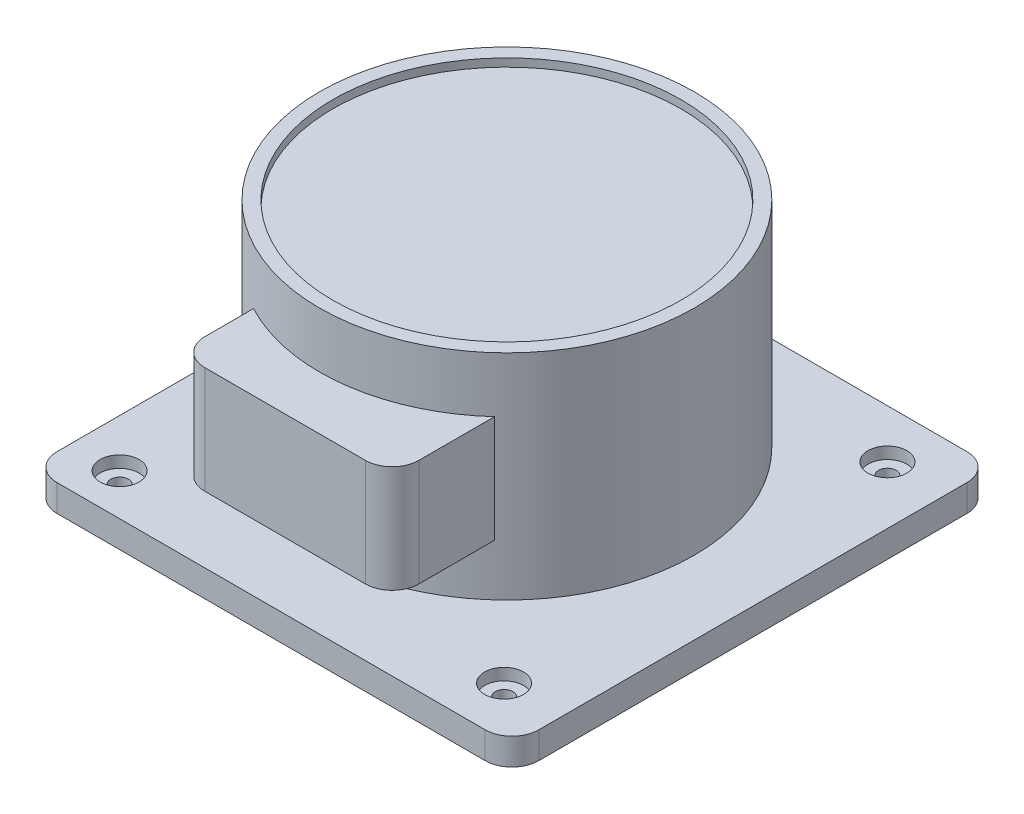
ISO-10303-21;
HEADER;
FILE_DESCRIPTION(('STEP AP214'),'2;1');
FILE_NAME('part.step','',(''),(''),'','','');
FILE_SCHEMA(('AUTOMOTIVE_DESIGN { 1 0 10303 214 1 1 1 1 }'));
ENDSEC;
DATA;
#1=APPLICATION_CONTEXT('core data for automotive mechanical design processes');
#2=APPLICATION_PROTOCOL_DEFINITION('international standard','automotive_design',2000,#1);
#3=PRODUCT_CONTEXT('',#1,'mechanical');
#4=PRODUCT('Part','Part','',(#3));
#5=PRODUCT_RELATED_PRODUCT_CATEGORY('part','',(#4));
#6=PRODUCT_DEFINITION_FORMATION('','',#4);
#7=PRODUCT_DEFINITION_CONTEXT('part definition',#1,'design');
#8=PRODUCT_DEFINITION('design','',#6,#7);
#9=PRODUCT_DEFINITION_SHAPE('','',#8);
#10=(LENGTH_UNIT() NAMED_UNIT(*) SI_UNIT(.MILLI.,.METRE.));
#11=(NAMED_UNIT(*) PLANE_ANGLE_UNIT() SI_UNIT($,.RADIAN.));
#12=(NAMED_UNIT(*) SI_UNIT($,.STERADIAN.) SOLID_ANGLE_UNIT());
#13=UNCERTAINTY_MEASURE_WITH_UNIT(LENGTH_MEASURE(1.E-05),#10,'distance_accuracy_value','');
#14=(GEOMETRIC_REPRESENTATION_CONTEXT(3) GLOBAL_UNCERTAINTY_ASSIGNED_CONTEXT((#13)) GLOBAL_UNIT_ASSIGNED_CONTEXT((#10,
#11,#12)) REPRESENTATION_CONTEXT('',''));
#15=CARTESIAN_POINT('',(0.,0.,0.));
#16=DIRECTION('',(0.,0.,1.));
#17=DIRECTION('',(1.,0.,0.));
#18=AXIS2_PLACEMENT_3D('',#15,#16,#17);
#19=CARTESIAN_POINT('',(-57.0066668541926,90.,0.));
#20=DIRECTION('',(0.,-1.,0.));
#21=DIRECTION('',(0.,0.,-1.));
#22=AXIS2_PLACEMENT_3D('',#19,#20,#21);
#23=CYLINDRICAL_SURFACE('',#22,70.);
#24=CARTESIAN_POINT('',(-57.0066668541926,10.,0.));
#25=DIRECTION('',(0.,1.,0.));
#26=DIRECTION('',(0.,0.,1.));
#27=AXIS2_PLACEMENT_3D('',#24,#25,#26);
#28=CIRCLE('',#27,70.);
#29=CARTESIAN_POINT('',(-57.0066668541926,10.,70.));
#30=VERTEX_POINT('',#29);
#31=EDGE_CURVE('E161',#30,#30,#28,.T.);
#32=ORIENTED_EDGE('',*,*,#31,.T.);
#33=EDGE_LOOP('',(#32));
#34=FACE_BOUND('',#33,.T.);
#35=CARTESIAN_POINT('',(-57.0066668541926,90.,0.));
#36=DIRECTION('',(0.,1.,0.));
#37=DIRECTION('',(0.,0.,1.));
#38=AXIS2_PLACEMENT_3D('',#35,#36,#37);
#39=CIRCLE('',#38,70.);
#40=CARTESIAN_POINT('',(-57.0066668541926,90.,70.));
#41=VERTEX_POINT('',#40);
#42=EDGE_CURVE('E236',#41,#41,#39,.T.);
#43=ORIENTED_EDGE('',*,*,#42,.F.);
#44=EDGE_LOOP('',(#43));
#45=FACE_BOUND('',#44,.T.);
#46=DIRECTION('',(0.,-1.,0.));
#47=VECTOR('',#46,1.);
#48=CARTESIAN_POINT('',(-89.8939404265472,90.,61.793423897508));
#49=LINE('',#48,#47);
#50=CARTESIAN_POINT('',(-89.8939404265472,69.2885310548801,61.793423897508));
#51=VERTEX_POINT('',#50);
#52=CARTESIAN_POINT('',(-89.8939404265472,29.2885310548801,61.793423897508));
#53=VERTEX_POINT('',#52);
#54=EDGE_CURVE('E138',#51,#53,#49,.T.);
#55=ORIENTED_EDGE('',*,*,#54,.F.);
#56=CARTESIAN_POINT('',(-57.0066668541926,69.2885310548801,0.));
#57=DIRECTION('',(0.,-1.,0.));
#58=DIRECTION('',(0.,0.,-1.));
#59=AXIS2_PLACEMENT_3D('',#56,#57,#58);
#60=CIRCLE('',#59,70.);
#61=CARTESIAN_POINT('',(-9.89394042654722,69.2885310548801,51.7724927790216));
#62=VERTEX_POINT('',#61);
#63=EDGE_CURVE('E151',#62,#51,#60,.T.);
#64=ORIENTED_EDGE('',*,*,#63,.F.);
#65=DIRECTION('',(0.,-1.,0.));
#66=VECTOR('',#65,1.);
#67=CARTESIAN_POINT('',(-9.8939404265472,90.,51.7724927790216));
#68=LINE('',#67,#66);
#69=CARTESIAN_POINT('',(-9.8939404265472,29.2885310548801,51.7724927790216));
#70=VERTEX_POINT('',#69);
#71=EDGE_CURVE('E160',#70,#62,#68,.F.);
#72=ORIENTED_EDGE('',*,*,#71,.F.);
#73=CARTESIAN_POINT('',(-57.0066668541926,29.2885310548801,0.));
#74=DIRECTION('',(0.,1.,0.));
#75=DIRECTION('',(-1.,0.,0.));
#76=AXIS2_PLACEMENT_3D('',#73,#74,#75);
#77=CIRCLE('',#76,70.);
#78=EDGE_CURVE('E154',#53,#70,#77,.T.);
#79=ORIENTED_EDGE('',*,*,#78,.F.);
#80=EDGE_LOOP('',(#55,#64,#72,#79));
#81=FACE_BOUND('',#80,.T.);
#82=ADVANCED_FACE('F32',(#34,#45,#81),#23,.T.);
#83=CARTESIAN_POINT('',(-139.591836734694,10.,-84.4897959183673));
#84=DIRECTION('',(1.,0.,0.));
#85=DIRECTION('',(0.,0.,-1.));
#86=AXIS2_PLACEMENT_3D('',#83,#84,#85);
#87=PLANE('',#86);
#88=DIRECTION('',(0.,0.,1.));
#89=VECTOR('',#88,1.);
#90=CARTESIAN_POINT('',(-139.591836734694,10.,-84.4897959183673));
#91=LINE('',#90,#89);
#92=CARTESIAN_POINT('',(-139.591836734694,10.,-74.4897959183673));
#93=VERTEX_POINT('',#92);
#94=CARTESIAN_POINT('',(-139.591836734694,10.,85.5102040816326));
#95=VERTEX_POINT('',#94);
#96=EDGE_CURVE('E244',#93,#95,#91,.T.);
#97=ORIENTED_EDGE('',*,*,#96,.F.);
#98=DIRECTION('',(0.,-1.,0.));
#99=VECTOR('',#98,1.);
#100=CARTESIAN_POINT('',(-139.591836734694,10.,-74.4897959183673));
#101=LINE('',#100,#99);
#102=CARTESIAN_POINT('',(-139.591836734694,0.,-74.4897959183673));
#103=VERTEX_POINT('',#102);
#104=EDGE_CURVE('E190',#93,#103,#101,.T.);
#105=ORIENTED_EDGE('',*,*,#104,.T.);
#106=DIRECTION('',(0.,0.,1.));
#107=VECTOR('',#106,1.);
#108=CARTESIAN_POINT('',(-139.591836734694,0.,-84.4897959183673));
#109=LINE('',#108,#107);
#110=CARTESIAN_POINT('',(-139.591836734694,0.,85.5102040816326));
#111=VERTEX_POINT('',#110);
#112=EDGE_CURVE('E234',#103,#111,#109,.T.);
#113=ORIENTED_EDGE('',*,*,#112,.T.);
#114=DIRECTION('',(0.,-1.,0.));
#115=VECTOR('',#114,1.);
#116=CARTESIAN_POINT('',(-139.591836734694,10.,85.5102040816327));
#117=LINE('',#116,#115);
#118=EDGE_CURVE('E188',#111,#95,#117,.F.);
#119=ORIENTED_EDGE('',*,*,#118,.T.);
#120=EDGE_LOOP('',(#97,#105,#113,#119));
#121=FACE_BOUND('',#120,.T.);
#122=ADVANCED_FACE('F339',(#121),#87,.F.);
#123=CARTESIAN_POINT('',(-139.591836734694,10.,95.5102040816327));
#124=DIRECTION('',(0.,0.,-1.));
#125=DIRECTION('',(-1.,0.,0.));
#126=AXIS2_PLACEMENT_3D('',#123,#124,#125);
#127=PLANE('',#126);
#128=DIRECTION('',(1.,0.,0.));
#129=VECTOR('',#128,1.);
#130=CARTESIAN_POINT('',(-139.591836734694,0.,95.5102040816327));
#131=LINE('',#130,#129);
#132=CARTESIAN_POINT('',(-129.591836734694,0.,95.5102040816327));
#133=VERTEX_POINT('',#132);
#134=CARTESIAN_POINT('',(30.4081632653062,0.,95.5102040816327));
#135=VERTEX_POINT('',#134);
#136=EDGE_CURVE('E223',#133,#135,#131,.T.);
#137=ORIENTED_EDGE('',*,*,#136,.T.);
#138=DIRECTION('',(0.,-1.,0.));
#139=VECTOR('',#138,1.);
#140=CARTESIAN_POINT('',(30.4081632653062,10.,95.5102040816327));
#141=LINE('',#140,#139);
#142=CARTESIAN_POINT('',(30.4081632653062,10.,95.5102040816327));
#143=VERTEX_POINT('',#142);
#144=EDGE_CURVE('E11',#135,#143,#141,.F.);
#145=ORIENTED_EDGE('',*,*,#144,.T.);
#146=DIRECTION('',(1.,0.,0.));
#147=VECTOR('',#146,1.);
#148=CARTESIAN_POINT('',(-139.591836734694,10.,95.5102040816327));
#149=LINE('',#148,#147);
#150=CARTESIAN_POINT('',(-129.591836734694,10.,95.5102040816327));
#151=VERTEX_POINT('',#150);
#152=EDGE_CURVE('E225',#151,#143,#149,.T.);
#153=ORIENTED_EDGE('',*,*,#152,.F.);
#154=DIRECTION('',(0.,-1.,0.));
#155=VECTOR('',#154,1.);
#156=CARTESIAN_POINT('',(-129.591836734694,10.,95.5102040816327));
#157=LINE('',#156,#155);
#158=EDGE_CURVE('E40',#151,#133,#157,.T.);
#159=ORIENTED_EDGE('',*,*,#158,.T.);
#160=EDGE_LOOP('',(#137,#145,#153,#159));
#161=FACE_BOUND('',#160,.T.);
#162=ADVANCED_FACE('F222',(#161),#127,.F.);
#163=CARTESIAN_POINT('',(40.4081632653061,10.,-84.4897959183674));
#164=DIRECTION('',(-1.,0.,0.));
#165=DIRECTION('',(0.,0.,1.));
#166=AXIS2_PLACEMENT_3D('',#163,#164,#165);
#167=PLANE('',#166);
#168=DIRECTION('',(0.,0.,-1.));
#169=VECTOR('',#168,1.);
#170=CARTESIAN_POINT('',(40.4081632653061,0.,-84.4897959183674));
#171=LINE('',#170,#169);
#172=CARTESIAN_POINT('',(40.4081632653062,0.,85.5102040816326));
#173=VERTEX_POINT('',#172);
#174=CARTESIAN_POINT('',(40.4081632653061,0.,-74.4897959183674));
#175=VERTEX_POINT('',#174);
#176=EDGE_CURVE('E233',#173,#175,#171,.T.);
#177=ORIENTED_EDGE('',*,*,#176,.T.);
#178=DIRECTION('',(0.,-1.,0.));
#179=VECTOR('',#178,1.);
#180=CARTESIAN_POINT('',(40.4081632653061,10.,-74.4897959183674));
#181=LINE('',#180,#179);
#182=CARTESIAN_POINT('',(40.4081632653061,10.,-74.4897959183674));
#183=VERTEX_POINT('',#182);
#184=EDGE_CURVE('E47',#175,#183,#181,.F.);
#185=ORIENTED_EDGE('',*,*,#184,.T.);
#186=DIRECTION('',(0.,0.,-1.));
#187=VECTOR('',#186,1.);
#188=CARTESIAN_POINT('',(40.4081632653061,10.,-84.4897959183674));
#189=LINE('',#188,#187);
#190=CARTESIAN_POINT('',(40.4081632653062,10.,85.5102040816326));
#191=VERTEX_POINT('',#190);
#192=EDGE_CURVE('E241',#191,#183,#189,.T.);
#193=ORIENTED_EDGE('',*,*,#192,.F.);
#194=DIRECTION('',(0.,-1.,0.));
#195=VECTOR('',#194,1.);
#196=CARTESIAN_POINT('',(40.4081632653062,10.,85.5102040816327));
#197=LINE('',#196,#195);
#198=EDGE_CURVE('E213',#191,#173,#197,.T.);
#199=ORIENTED_EDGE('',*,*,#198,.T.);
#200=EDGE_LOOP('',(#177,#185,#193,#199));
#201=FACE_BOUND('',#200,.T.);
#202=ADVANCED_FACE('F345',(#201),#167,.F.);
#203=CARTESIAN_POINT('',(-139.591836734694,10.,-84.4897959183673));
#204=DIRECTION('',(0.,0.,1.));
#205=DIRECTION('',(1.,0.,0.));
#206=AXIS2_PLACEMENT_3D('',#203,#204,#205);
#207=PLANE('',#206);
#208=DIRECTION('',(-1.,0.,0.));
#209=VECTOR('',#208,1.);
#210=CARTESIAN_POINT('',(-139.591836734694,0.,-84.4897959183673));
#211=LINE('',#210,#209);
#212=CARTESIAN_POINT('',(30.408163265306,0.,-84.4897959183674));
#213=VERTEX_POINT('',#212);
#214=CARTESIAN_POINT('',(-129.591836734694,0.,-84.4897959183673));
#215=VERTEX_POINT('',#214);
#216=EDGE_CURVE('E168',#213,#215,#211,.T.);
#217=ORIENTED_EDGE('',*,*,#216,.T.);
#218=DIRECTION('',(0.,-1.,0.));
#219=VECTOR('',#218,1.);
#220=CARTESIAN_POINT('',(-129.591836734694,10.,-84.4897959183673));
#221=LINE('',#220,#219);
#222=CARTESIAN_POINT('',(-129.591836734694,10.,-84.4897959183673));
#223=VERTEX_POINT('',#222);
#224=EDGE_CURVE('E204',#215,#223,#221,.F.);
#225=ORIENTED_EDGE('',*,*,#224,.T.);
#226=DIRECTION('',(-1.,0.,0.));
#227=VECTOR('',#226,1.);
#228=CARTESIAN_POINT('',(-139.591836734694,10.,-84.4897959183673));
#229=LINE('',#228,#227);
#230=CARTESIAN_POINT('',(30.408163265306,10.,-84.4897959183674));
#231=VERTEX_POINT('',#230);
#232=EDGE_CURVE('E165',#231,#223,#229,.T.);
#233=ORIENTED_EDGE('',*,*,#232,.F.);
#234=DIRECTION('',(0.,-1.,0.));
#235=VECTOR('',#234,1.);
#236=CARTESIAN_POINT('',(30.4081632653061,10.,-84.4897959183674));
#237=LINE('',#236,#235);
#238=EDGE_CURVE('E201',#231,#213,#237,.T.);
#239=ORIENTED_EDGE('',*,*,#238,.T.);
#240=EDGE_LOOP('',(#217,#225,#233,#239));
#241=FACE_BOUND('',#240,.T.);
#242=ADVANCED_FACE('F319',(#241),#207,.F.);
#243=CARTESIAN_POINT('',(0.,10.,0.));
#244=DIRECTION('',(0.,1.,0.));
#245=DIRECTION('',(0.,0.,1.));
#246=AXIS2_PLACEMENT_3D('',#243,#244,#245);
#247=PLANE('',#246);
#248=CARTESIAN_POINT('',(-121.727687167638,10.,-66.3147180673324));
#249=DIRECTION('',(0.,1.,0.));
#250=DIRECTION('',(0.,0.,1.));
#251=AXIS2_PLACEMENT_3D('',#248,#249,#250);
#252=CIRCLE('',#251,7.27499999999999);
#253=CARTESIAN_POINT('',(-121.727687167638,10.,-59.0397180673324));
#254=VERTEX_POINT('',#253);
#255=EDGE_CURVE('E310',#254,#254,#252,.T.);
#256=ORIENTED_EDGE('',*,*,#255,.F.);
#257=EDGE_LOOP('',(#256));
#258=FACE_BOUND('',#257,.T.);
#259=CARTESIAN_POINT('',(18.8544200343106,10.,-66.3147180673324));
#260=DIRECTION('',(0.,1.,0.));
#261=DIRECTION('',(0.,0.,1.));
#262=AXIS2_PLACEMENT_3D('',#259,#260,#261);
#263=CIRCLE('',#262,7.27499999999999);
#264=CARTESIAN_POINT('',(18.8544200343106,10.,-59.0397180673324));
#265=VERTEX_POINT('',#264);
#266=EDGE_CURVE('E298',#265,#265,#263,.T.);
#267=ORIENTED_EDGE('',*,*,#266,.F.);
#268=EDGE_LOOP('',(#267));
#269=FACE_BOUND('',#268,.T.);
#270=CARTESIAN_POINT('',(18.8544200343106,10.,76.9115666995437));
#271=DIRECTION('',(0.,1.,0.));
#272=DIRECTION('',(0.,0.,1.));
#273=AXIS2_PLACEMENT_3D('',#270,#271,#272);
#274=CIRCLE('',#273,7.27499999999999);
#275=CARTESIAN_POINT('',(18.8544200343106,10.,84.1865666995436));
#276=VERTEX_POINT('',#275);
#277=EDGE_CURVE('E286',#276,#276,#274,.T.);
#278=ORIENTED_EDGE('',*,*,#277,.F.);
#279=EDGE_LOOP('',(#278));
#280=FACE_BOUND('',#279,.T.);
#281=CARTESIAN_POINT('',(-121.727687167638,10.,79.9964405252918));
#282=DIRECTION('',(0.,1.,0.));
#283=DIRECTION('',(0.,0.,1.));
#284=AXIS2_PLACEMENT_3D('',#281,#282,#283);
#285=CIRCLE('',#284,7.27499999999999);
#286=CARTESIAN_POINT('',(-121.727687167638,10.,87.2714405252918));
#287=VERTEX_POINT('',#286);
#288=EDGE_CURVE('E274',#287,#287,#285,.T.);
#289=ORIENTED_EDGE('',*,*,#288,.F.);
#290=EDGE_LOOP('',(#289));
#291=FACE_BOUND('',#290,.T.);
#292=ORIENTED_EDGE('',*,*,#31,.F.);
#293=EDGE_LOOP('',(#292));
#294=FACE_BOUND('',#293,.T.);
#295=ORIENTED_EDGE('',*,*,#232,.T.);
#296=CARTESIAN_POINT('',(-129.591836734694,10.,-74.4897959183673));
#297=DIRECTION('',(0.,1.,0.));
#298=DIRECTION('',(0.,0.,1.));
#299=AXIS2_PLACEMENT_3D('',#296,#297,#298);
#300=CIRCLE('',#299,10.);
#301=EDGE_CURVE('E211',#223,#93,#300,.T.);
#302=ORIENTED_EDGE('',*,*,#301,.T.);
#303=ORIENTED_EDGE('',*,*,#96,.T.);
#304=CARTESIAN_POINT('',(-129.591836734694,10.,85.5102040816327));
#305=DIRECTION('',(0.,1.,0.));
#306=DIRECTION('',(0.,0.,1.));
#307=AXIS2_PLACEMENT_3D('',#304,#305,#306);
#308=CIRCLE('',#307,10.);
#309=EDGE_CURVE('E206',#95,#151,#308,.T.);
#310=ORIENTED_EDGE('',*,*,#309,.T.);
#311=ORIENTED_EDGE('',*,*,#152,.T.);
#312=CARTESIAN_POINT('',(30.4081632653062,10.,85.5102040816327));
#313=DIRECTION('',(0.,1.,0.));
#314=DIRECTION('',(0.,0.,1.));
#315=AXIS2_PLACEMENT_3D('',#312,#313,#314);
#316=CIRCLE('',#315,10.);
#317=EDGE_CURVE('E54',#143,#191,#316,.T.);
#318=ORIENTED_EDGE('',*,*,#317,.T.);
#319=ORIENTED_EDGE('',*,*,#192,.T.);
#320=CARTESIAN_POINT('',(30.4081632653061,10.,-74.4897959183674));
#321=DIRECTION('',(0.,1.,0.));
#322=DIRECTION('',(0.,0.,1.));
#323=AXIS2_PLACEMENT_3D('',#320,#321,#322);
#324=CIRCLE('',#323,10.);
#325=EDGE_CURVE('E209',#183,#231,#324,.T.);
#326=ORIENTED_EDGE('',*,*,#325,.T.);
#327=EDGE_LOOP('',(#295,#302,#303,#310,#311,#318,#319,#326));
#328=FACE_BOUND('',#327,.T.);
#329=ADVANCED_FACE('F316',(#258,#269,#280,#291,#294,#328),#247,.T.);
#330=CARTESIAN_POINT('',(0.,0.,0.));
#331=DIRECTION('',(0.,1.,0.));
#332=DIRECTION('',(0.,0.,1.));
#333=AXIS2_PLACEMENT_3D('',#330,#331,#332);
#334=PLANE('',#333);
#335=CARTESIAN_POINT('',(-121.727687167638,0.,-66.3147180673324));
#336=DIRECTION('',(0.,1.,0.));
#337=DIRECTION('',(0.,0.,1.));
#338=AXIS2_PLACEMENT_3D('',#335,#336,#337);
#339=CIRCLE('',#338,3.3);
#340=CARTESIAN_POINT('',(-121.727687167638,0.,-63.0147180673324));
#341=VERTEX_POINT('',#340);
#342=EDGE_CURVE('E301',#341,#341,#339,.T.);
#343=ORIENTED_EDGE('',*,*,#342,.T.);
#344=EDGE_LOOP('',(#343));
#345=FACE_BOUND('',#344,.T.);
#346=CARTESIAN_POINT('',(18.8544200343106,0.,-66.3147180673324));
#347=DIRECTION('',(0.,1.,0.));
#348=DIRECTION('',(0.,0.,1.));
#349=AXIS2_PLACEMENT_3D('',#346,#347,#348);
#350=CIRCLE('',#349,3.3);
#351=CARTESIAN_POINT('',(18.8544200343106,0.,-63.0147180673324));
#352=VERTEX_POINT('',#351);
#353=EDGE_CURVE('E289',#352,#352,#350,.T.);
#354=ORIENTED_EDGE('',*,*,#353,.T.);
#355=EDGE_LOOP('',(#354));
#356=FACE_BOUND('',#355,.T.);
#357=CARTESIAN_POINT('',(18.8544200343106,0.,76.9115666995437));
#358=DIRECTION('',(0.,1.,0.));
#359=DIRECTION('',(0.,0.,1.));
#360=AXIS2_PLACEMENT_3D('',#357,#358,#359);
#361=CIRCLE('',#360,3.3);
#362=CARTESIAN_POINT('',(18.8544200343106,0.,80.2115666995437));
#363=VERTEX_POINT('',#362);
#364=EDGE_CURVE('E277',#363,#363,#361,.T.);
#365=ORIENTED_EDGE('',*,*,#364,.T.);
#366=EDGE_LOOP('',(#365));
#367=FACE_BOUND('',#366,.T.);
#368=CARTESIAN_POINT('',(-121.727687167638,0.,79.9964405252918));
#369=DIRECTION('',(0.,1.,0.));
#370=DIRECTION('',(0.,0.,1.));
#371=AXIS2_PLACEMENT_3D('',#368,#369,#370);
#372=CIRCLE('',#371,3.3);
#373=CARTESIAN_POINT('',(-121.727687167638,0.,83.2964405252918));
#374=VERTEX_POINT('',#373);
#375=EDGE_CURVE('E263',#374,#374,#372,.T.);
#376=ORIENTED_EDGE('',*,*,#375,.T.);
#377=EDGE_LOOP('',(#376));
#378=FACE_BOUND('',#377,.T.);
#379=ORIENTED_EDGE('',*,*,#112,.F.);
#380=CARTESIAN_POINT('',(-129.591836734694,0.,-74.4897959183673));
#381=DIRECTION('',(0.,1.,0.));
#382=DIRECTION('',(0.,0.,1.));
#383=AXIS2_PLACEMENT_3D('',#380,#381,#382);
#384=CIRCLE('',#383,10.);
#385=EDGE_CURVE('E199',#103,#215,#384,.F.);
#386=ORIENTED_EDGE('',*,*,#385,.T.);
#387=ORIENTED_EDGE('',*,*,#216,.F.);
#388=CARTESIAN_POINT('',(30.4081632653061,0.,-74.4897959183674));
#389=DIRECTION('',(0.,1.,0.));
#390=DIRECTION('',(0.,0.,1.));
#391=AXIS2_PLACEMENT_3D('',#388,#389,#390);
#392=CIRCLE('',#391,10.);
#393=EDGE_CURVE('E197',#213,#175,#392,.F.);
#394=ORIENTED_EDGE('',*,*,#393,.T.);
#395=ORIENTED_EDGE('',*,*,#176,.F.);
#396=CARTESIAN_POINT('',(30.4081632653062,0.,85.5102040816327));
#397=DIRECTION('',(0.,1.,0.));
#398=DIRECTION('',(0.,0.,1.));
#399=AXIS2_PLACEMENT_3D('',#396,#397,#398);
#400=CIRCLE('',#399,10.);
#401=EDGE_CURVE('E195',#173,#135,#400,.F.);
#402=ORIENTED_EDGE('',*,*,#401,.T.);
#403=ORIENTED_EDGE('',*,*,#136,.F.);
#404=CARTESIAN_POINT('',(-129.591836734694,0.,85.5102040816327));
#405=DIRECTION('',(0.,1.,0.));
#406=DIRECTION('',(0.,0.,1.));
#407=AXIS2_PLACEMENT_3D('',#404,#405,#406);
#408=CIRCLE('',#407,10.);
#409=EDGE_CURVE('E193',#133,#111,#408,.F.);
#410=ORIENTED_EDGE('',*,*,#409,.T.);
#411=EDGE_LOOP('',(#379,#386,#387,#394,#395,#402,#403,#410));
#412=FACE_BOUND('',#411,.T.);
#413=ADVANCED_FACE('F230',(#345,#356,#367,#378,#412),#334,.F.);
#414=CARTESIAN_POINT('',(-57.0066668541926,90.,0.));
#415=DIRECTION('',(0.,1.,0.));
#416=DIRECTION('',(0.,0.,1.));
#417=AXIS2_PLACEMENT_3D('',#414,#415,#416);
#418=PLANE('',#417);
#419=CARTESIAN_POINT('',(-57.0066668541926,90.,0.));
#420=DIRECTION('',(0.,1.,0.));
#421=DIRECTION('',(0.,0.,1.));
#422=AXIS2_PLACEMENT_3D('',#419,#420,#421);
#423=CIRCLE('',#422,65.);
#424=CARTESIAN_POINT('',(-57.0066668541926,90.,65.));
#425=VERTEX_POINT('',#424);
#426=EDGE_CURVE('E260',#425,#425,#423,.T.);
#427=ORIENTED_EDGE('',*,*,#426,.F.);
#428=EDGE_LOOP('',(#427));
#429=FACE_BOUND('',#428,.T.);
#430=ORIENTED_EDGE('',*,*,#42,.T.);
#431=EDGE_LOOP('',(#430));
#432=FACE_BOUND('',#431,.T.);
#433=ADVANCED_FACE('F362',(#429,#432),#418,.T.);
#434=CARTESIAN_POINT('',(-89.8939404265472,69.2885310548801,90.));
#435=DIRECTION('',(1.,0.,0.));
#436=DIRECTION('',(0.,0.,-1.));
#437=AXIS2_PLACEMENT_3D('',#434,#435,#436);
#438=PLANE('',#437);
#439=DIRECTION('',(0.,0.,-1.));
#440=VECTOR('',#439,1.);
#441=CARTESIAN_POINT('',(-89.8939404265472,29.2885310548801,90.));
#442=LINE('',#441,#440);
#443=CARTESIAN_POINT('',(-89.8939404265472,29.2885310548801,80.));
#444=VERTEX_POINT('',#443);
#445=EDGE_CURVE('E249',#444,#53,#442,.T.);
#446=ORIENTED_EDGE('',*,*,#445,.F.);
#447=DIRECTION('',(0.,-1.,0.));
#448=VECTOR('',#447,1.);
#449=CARTESIAN_POINT('',(-89.8939404265472,69.2885310548801,80.));
#450=LINE('',#449,#448);
#451=CARTESIAN_POINT('',(-89.8939404265472,69.2885310548801,80.));
#452=VERTEX_POINT('',#451);
#453=EDGE_CURVE('E140',#444,#452,#450,.F.);
#454=ORIENTED_EDGE('',*,*,#453,.T.);
#455=DIRECTION('',(0.,0.,-1.));
#456=VECTOR('',#455,1.);
#457=CARTESIAN_POINT('',(-89.8939404265472,69.2885310548801,90.));
#458=LINE('',#457,#456);
#459=EDGE_CURVE('E134',#452,#51,#458,.T.);
#460=ORIENTED_EDGE('',*,*,#459,.T.);
#461=ORIENTED_EDGE('',*,*,#54,.T.);
#462=EDGE_LOOP('',(#446,#454,#460,#461));
#463=FACE_BOUND('',#462,.T.);
#464=ADVANCED_FACE('F137',(#463),#438,.F.);
#465=CARTESIAN_POINT('',(-9.89394042654719,69.2885310548801,90.));
#466=DIRECTION('',(-1.,0.,0.));
#467=DIRECTION('',(0.,0.,1.));
#468=AXIS2_PLACEMENT_3D('',#465,#466,#467);
#469=PLANE('',#468);
#470=DIRECTION('',(0.,0.,-1.));
#471=VECTOR('',#470,1.);
#472=CARTESIAN_POINT('',(-9.89394042654719,69.2885310548801,90.));
#473=LINE('',#472,#471);
#474=CARTESIAN_POINT('',(-9.89394042654719,69.2885310548801,80.));
#475=VERTEX_POINT('',#474);
#476=EDGE_CURVE('E144',#475,#62,#473,.T.);
#477=ORIENTED_EDGE('',*,*,#476,.F.);
#478=DIRECTION('',(0.,1.,0.));
#479=VECTOR('',#478,1.);
#480=CARTESIAN_POINT('',(-9.89394042654719,29.2885310548801,80.));
#481=LINE('',#480,#479);
#482=CARTESIAN_POINT('',(-9.89394042654719,29.2885310548801,80.));
#483=VERTEX_POINT('',#482);
#484=EDGE_CURVE('E181',#475,#483,#481,.F.);
#485=ORIENTED_EDGE('',*,*,#484,.T.);
#486=DIRECTION('',(0.,0.,-1.));
#487=VECTOR('',#486,1.);
#488=CARTESIAN_POINT('',(-9.89394042654719,29.2885310548801,90.));
#489=LINE('',#488,#487);
#490=EDGE_CURVE('E251',#483,#70,#489,.T.);
#491=ORIENTED_EDGE('',*,*,#490,.T.);
#492=ORIENTED_EDGE('',*,*,#71,.T.);
#493=EDGE_LOOP('',(#477,#485,#491,#492));
#494=FACE_BOUND('',#493,.T.);
#495=ADVANCED_FACE('F567',(#494),#469,.F.);
#496=CARTESIAN_POINT('',(-89.8939404265472,29.2885310548801,90.));
#497=DIRECTION('',(0.,1.,0.));
#498=DIRECTION('',(-1.,0.,0.));
#499=AXIS2_PLACEMENT_3D('',#496,#497,#498);
#500=PLANE('',#499);
#501=ORIENTED_EDGE('',*,*,#490,.F.);
#502=CARTESIAN_POINT('',(-19.8939404265472,29.2885310548801,80.));
#503=DIRECTION('',(0.,1.,0.));
#504=DIRECTION('',(-1.,0.,0.));
#505=AXIS2_PLACEMENT_3D('',#502,#503,#504);
#506=CIRCLE('',#505,10.);
#507=CARTESIAN_POINT('',(-19.8939404265472,29.2885310548801,90.));
#508=VERTEX_POINT('',#507);
#509=EDGE_CURVE('E185',#483,#508,#506,.F.);
#510=ORIENTED_EDGE('',*,*,#509,.T.);
#511=DIRECTION('',(1.,0.,0.));
#512=VECTOR('',#511,1.);
#513=CARTESIAN_POINT('',(-89.8939404265472,29.2885310548801,90.));
#514=LINE('',#513,#512);
#515=CARTESIAN_POINT('',(-79.8939404265472,29.2885310548801,90.));
#516=VERTEX_POINT('',#515);
#517=EDGE_CURVE('E256',#516,#508,#514,.T.);
#518=ORIENTED_EDGE('',*,*,#517,.F.);
#519=CARTESIAN_POINT('',(-79.8939404265472,29.2885310548801,80.));
#520=DIRECTION('',(0.,1.,0.));
#521=DIRECTION('',(-1.,0.,0.));
#522=AXIS2_PLACEMENT_3D('',#519,#520,#521);
#523=CIRCLE('',#522,10.);
#524=EDGE_CURVE('E183',#516,#444,#523,.F.);
#525=ORIENTED_EDGE('',*,*,#524,.T.);
#526=ORIENTED_EDGE('',*,*,#445,.T.);
#527=ORIENTED_EDGE('',*,*,#78,.T.);
#528=EDGE_LOOP('',(#501,#510,#518,#525,#526,#527));
#529=FACE_BOUND('',#528,.T.);
#530=ADVANCED_FACE('F559',(#529),#500,.F.);
#531=CARTESIAN_POINT('',(-89.8939404265472,69.2885310548801,90.));
#532=DIRECTION('',(0.,-1.,0.));
#533=DIRECTION('',(0.,0.,-1.));
#534=AXIS2_PLACEMENT_3D('',#531,#532,#533);
#535=PLANE('',#534);
#536=DIRECTION('',(-1.,0.,0.));
#537=VECTOR('',#536,1.);
#538=CARTESIAN_POINT('',(-89.8939404265472,69.2885310548801,90.));
#539=LINE('',#538,#537);
#540=CARTESIAN_POINT('',(-19.8939404265472,69.2885310548801,90.));
#541=VERTEX_POINT('',#540);
#542=CARTESIAN_POINT('',(-79.8939404265472,69.2885310548801,90.));
#543=VERTEX_POINT('',#542);
#544=EDGE_CURVE('E145',#541,#543,#539,.T.);
#545=ORIENTED_EDGE('',*,*,#544,.F.);
#546=CARTESIAN_POINT('',(-19.8939404265472,69.2885310548801,80.));
#547=DIRECTION('',(0.,-1.,0.));
#548=DIRECTION('',(0.,0.,-1.));
#549=AXIS2_PLACEMENT_3D('',#546,#547,#548);
#550=CIRCLE('',#549,10.);
#551=EDGE_CURVE('E179',#541,#475,#550,.F.);
#552=ORIENTED_EDGE('',*,*,#551,.T.);
#553=ORIENTED_EDGE('',*,*,#476,.T.);
#554=ORIENTED_EDGE('',*,*,#63,.T.);
#555=ORIENTED_EDGE('',*,*,#459,.F.);
#556=CARTESIAN_POINT('',(-79.8939404265472,69.2885310548801,80.));
#557=DIRECTION('',(0.,-1.,0.));
#558=DIRECTION('',(0.,0.,-1.));
#559=AXIS2_PLACEMENT_3D('',#556,#557,#558);
#560=CIRCLE('',#559,10.);
#561=EDGE_CURVE('E177',#452,#543,#560,.F.);
#562=ORIENTED_EDGE('',*,*,#561,.T.);
#563=EDGE_LOOP('',(#545,#552,#553,#554,#555,#562));
#564=FACE_BOUND('',#563,.T.);
#565=ADVANCED_FACE('F158',(#564),#535,.F.);
#566=CARTESIAN_POINT('',(0.,0.,90.));
#567=DIRECTION('',(0.,0.,1.));
#568=DIRECTION('',(1.,0.,0.));
#569=AXIS2_PLACEMENT_3D('',#566,#567,#568);
#570=PLANE('',#569);
#571=ORIENTED_EDGE('',*,*,#517,.T.);
#572=DIRECTION('',(0.,1.,0.));
#573=VECTOR('',#572,1.);
#574=CARTESIAN_POINT('',(-19.8939404265472,69.2885310548801,90.));
#575=LINE('',#574,#573);
#576=EDGE_CURVE('E174',#508,#541,#575,.T.);
#577=ORIENTED_EDGE('',*,*,#576,.T.);
#578=ORIENTED_EDGE('',*,*,#544,.T.);
#579=DIRECTION('',(0.,-1.,0.));
#580=VECTOR('',#579,1.);
#581=CARTESIAN_POINT('',(-79.8939404265472,29.2885310548801,90.));
#582=LINE('',#581,#580);
#583=EDGE_CURVE('E155',#543,#516,#582,.T.);
#584=ORIENTED_EDGE('',*,*,#583,.T.);
#585=EDGE_LOOP('',(#571,#577,#578,#584));
#586=FACE_BOUND('',#585,.T.);
#587=ADVANCED_FACE('F542',(#586),#570,.T.);
#588=CARTESIAN_POINT('',(-57.0066668541926,87.,0.));
#589=DIRECTION('',(0.,1.,0.));
#590=DIRECTION('',(0.,0.,1.));
#591=AXIS2_PLACEMENT_3D('',#588,#589,#590);
#592=CYLINDRICAL_SURFACE('',#591,65.);
#593=CARTESIAN_POINT('',(-57.0066668541926,87.,0.));
#594=DIRECTION('',(0.,1.,0.));
#595=DIRECTION('',(0.,0.,1.));
#596=AXIS2_PLACEMENT_3D('',#593,#594,#595);
#597=CIRCLE('',#596,65.);
#598=CARTESIAN_POINT('',(-57.0066668541926,87.,65.));
#599=VERTEX_POINT('',#598);
#600=EDGE_CURVE('E259',#599,#599,#597,.T.);
#601=ORIENTED_EDGE('',*,*,#600,.F.);
#602=EDGE_LOOP('',(#601));
#603=FACE_BOUND('',#602,.T.);
#604=ORIENTED_EDGE('',*,*,#426,.T.);
#605=EDGE_LOOP('',(#604));
#606=FACE_BOUND('',#605,.T.);
#607=ADVANCED_FACE('F533',(#603,#606),#592,.F.);
#608=CARTESIAN_POINT('',(-57.0066668541926,87.,0.));
#609=DIRECTION('',(0.,1.,0.));
#610=DIRECTION('',(0.,0.,1.));
#611=AXIS2_PLACEMENT_3D('',#608,#609,#610);
#612=PLANE('',#611);
#613=ORIENTED_EDGE('',*,*,#600,.T.);
#614=EDGE_LOOP('',(#613));
#615=FACE_BOUND('',#614,.T.);
#616=ADVANCED_FACE('F524',(#615),#612,.T.);
#617=CARTESIAN_POINT('',(-121.727687167638,10.,79.9964405252918));
#618=DIRECTION('',(0.,1.,0.));
#619=DIRECTION('',(0.,0.,1.));
#620=AXIS2_PLACEMENT_3D('',#617,#618,#619);
#621=CYLINDRICAL_SURFACE('',#620,3.3);
#622=ORIENTED_EDGE('',*,*,#375,.F.);
#623=EDGE_LOOP('',(#622));
#624=FACE_BOUND('',#623,.T.);
#625=CARTESIAN_POINT('',(-121.727687167638,5.62,79.9964405252918));
#626=DIRECTION('',(0.,1.,0.));
#627=DIRECTION('',(0.,0.,1.));
#628=AXIS2_PLACEMENT_3D('',#625,#626,#627);
#629=CIRCLE('',#628,3.3);
#630=CARTESIAN_POINT('',(-121.727687167638,5.62,83.2964405252918));
#631=VERTEX_POINT('',#630);
#632=EDGE_CURVE('E268',#631,#631,#629,.T.);
#633=ORIENTED_EDGE('',*,*,#632,.T.);
#634=EDGE_LOOP('',(#633));
#635=FACE_BOUND('',#634,.T.);
#636=ADVANCED_FACE('F515',(#624,#635),#621,.F.);
#637=CARTESIAN_POINT('',(-118.427687167638,5.62,79.9964405252918));
#638=DIRECTION('',(0.,-1.,0.));
#639=DIRECTION('',(0.,0.,-1.));
#640=AXIS2_PLACEMENT_3D('',#637,#638,#639);
#641=PLANE('',#640);
#642=ORIENTED_EDGE('',*,*,#632,.F.);
#643=EDGE_LOOP('',(#642));
#644=FACE_BOUND('',#643,.T.);
#645=CARTESIAN_POINT('',(-121.727687167638,5.62,79.9964405252918));
#646=DIRECTION('',(0.,1.,0.));
#647=DIRECTION('',(0.,0.,1.));
#648=AXIS2_PLACEMENT_3D('',#645,#646,#647);
#649=CIRCLE('',#648,7.275);
#650=CARTESIAN_POINT('',(-121.727687167638,5.62,87.2714405252918));
#651=VERTEX_POINT('',#650);
#652=EDGE_CURVE('E271',#651,#651,#649,.T.);
#653=ORIENTED_EDGE('',*,*,#652,.T.);
#654=EDGE_LOOP('',(#653));
#655=FACE_BOUND('',#654,.T.);
#656=ADVANCED_FACE('F506',(#644,#655),#641,.F.);
#657=CARTESIAN_POINT('',(-121.727687167638,10.,79.9964405252918));
#658=DIRECTION('',(0.,1.,0.));
#659=DIRECTION('',(0.,0.,1.));
#660=AXIS2_PLACEMENT_3D('',#657,#658,#659);
#661=CYLINDRICAL_SURFACE('',#660,7.275);
#662=ORIENTED_EDGE('',*,*,#652,.F.);
#663=EDGE_LOOP('',(#662));
#664=FACE_BOUND('',#663,.T.);
#665=ORIENTED_EDGE('',*,*,#288,.T.);
#666=EDGE_LOOP('',(#665));
#667=FACE_BOUND('',#666,.T.);
#668=ADVANCED_FACE('F497',(#664,#667),#661,.F.);
#669=CARTESIAN_POINT('',(18.8544200343106,10.,76.9115666995437));
#670=DIRECTION('',(0.,1.,0.));
#671=DIRECTION('',(0.,0.,1.));
#672=AXIS2_PLACEMENT_3D('',#669,#670,#671);
#673=CYLINDRICAL_SURFACE('',#672,3.3);
#674=ORIENTED_EDGE('',*,*,#364,.F.);
#675=EDGE_LOOP('',(#674));
#676=FACE_BOUND('',#675,.T.);
#677=CARTESIAN_POINT('',(18.8544200343106,5.62,76.9115666995437));
#678=DIRECTION('',(0.,1.,0.));
#679=DIRECTION('',(0.,0.,1.));
#680=AXIS2_PLACEMENT_3D('',#677,#678,#679);
#681=CIRCLE('',#680,3.3);
#682=CARTESIAN_POINT('',(18.8544200343106,5.62,80.2115666995437));
#683=VERTEX_POINT('',#682);
#684=EDGE_CURVE('E280',#683,#683,#681,.T.);
#685=ORIENTED_EDGE('',*,*,#684,.T.);
#686=EDGE_LOOP('',(#685));
#687=FACE_BOUND('',#686,.T.);
#688=ADVANCED_FACE('F488',(#676,#687),#673,.F.);
#689=CARTESIAN_POINT('',(22.1544200343106,5.62,76.9115666995437));
#690=DIRECTION('',(0.,-1.,0.));
#691=DIRECTION('',(0.,0.,-1.));
#692=AXIS2_PLACEMENT_3D('',#689,#690,#691);
#693=PLANE('',#692);
#694=ORIENTED_EDGE('',*,*,#684,.F.);
#695=EDGE_LOOP('',(#694));
#696=FACE_BOUND('',#695,.T.);
#697=CARTESIAN_POINT('',(18.8544200343106,5.62,76.9115666995437));
#698=DIRECTION('',(0.,1.,0.));
#699=DIRECTION('',(0.,0.,1.));
#700=AXIS2_PLACEMENT_3D('',#697,#698,#699);
#701=CIRCLE('',#700,7.275);
#702=CARTESIAN_POINT('',(18.8544200343106,5.62,84.1865666995437));
#703=VERTEX_POINT('',#702);
#704=EDGE_CURVE('E283',#703,#703,#701,.T.);
#705=ORIENTED_EDGE('',*,*,#704,.T.);
#706=EDGE_LOOP('',(#705));
#707=FACE_BOUND('',#706,.T.);
#708=ADVANCED_FACE('F479',(#696,#707),#693,.F.);
#709=CARTESIAN_POINT('',(18.8544200343106,10.,76.9115666995437));
#710=DIRECTION('',(0.,1.,0.));
#711=DIRECTION('',(0.,0.,1.));
#712=AXIS2_PLACEMENT_3D('',#709,#710,#711);
#713=CYLINDRICAL_SURFACE('',#712,7.275);
#714=ORIENTED_EDGE('',*,*,#704,.F.);
#715=EDGE_LOOP('',(#714));
#716=FACE_BOUND('',#715,.T.);
#717=ORIENTED_EDGE('',*,*,#277,.T.);
#718=EDGE_LOOP('',(#717));
#719=FACE_BOUND('',#718,.T.);
#720=ADVANCED_FACE('F470',(#716,#719),#713,.F.);
#721=CARTESIAN_POINT('',(18.8544200343106,10.,-66.3147180673324));
#722=DIRECTION('',(0.,1.,0.));
#723=DIRECTION('',(0.,0.,1.));
#724=AXIS2_PLACEMENT_3D('',#721,#722,#723);
#725=CYLINDRICAL_SURFACE('',#724,3.3);
#726=ORIENTED_EDGE('',*,*,#353,.F.);
#727=EDGE_LOOP('',(#726));
#728=FACE_BOUND('',#727,.T.);
#729=CARTESIAN_POINT('',(18.8544200343106,5.62,-66.3147180673324));
#730=DIRECTION('',(0.,1.,0.));
#731=DIRECTION('',(0.,0.,1.));
#732=AXIS2_PLACEMENT_3D('',#729,#730,#731);
#733=CIRCLE('',#732,3.3);
#734=CARTESIAN_POINT('',(18.8544200343106,5.62,-63.0147180673324));
#735=VERTEX_POINT('',#734);
#736=EDGE_CURVE('E292',#735,#735,#733,.T.);
#737=ORIENTED_EDGE('',*,*,#736,.T.);
#738=EDGE_LOOP('',(#737));
#739=FACE_BOUND('',#738,.T.);
#740=ADVANCED_FACE('F461',(#728,#739),#725,.F.);
#741=CARTESIAN_POINT('',(22.1544200343106,5.62,-66.3147180673324));
#742=DIRECTION('',(0.,-1.,0.));
#743=DIRECTION('',(0.,0.,-1.));
#744=AXIS2_PLACEMENT_3D('',#741,#742,#743);
#745=PLANE('',#744);
#746=ORIENTED_EDGE('',*,*,#736,.F.);
#747=EDGE_LOOP('',(#746));
#748=FACE_BOUND('',#747,.T.);
#749=CARTESIAN_POINT('',(18.8544200343106,5.62,-66.3147180673324));
#750=DIRECTION('',(0.,1.,0.));
#751=DIRECTION('',(0.,0.,1.));
#752=AXIS2_PLACEMENT_3D('',#749,#750,#751);
#753=CIRCLE('',#752,7.275);
#754=CARTESIAN_POINT('',(18.8544200343106,5.62,-59.0397180673324));
#755=VERTEX_POINT('',#754);
#756=EDGE_CURVE('E295',#755,#755,#753,.T.);
#757=ORIENTED_EDGE('',*,*,#756,.T.);
#758=EDGE_LOOP('',(#757));
#759=FACE_BOUND('',#758,.T.);
#760=ADVANCED_FACE('F452',(#748,#759),#745,.F.);
#761=CARTESIAN_POINT('',(18.8544200343106,10.,-66.3147180673324));
#762=DIRECTION('',(0.,1.,0.));
#763=DIRECTION('',(0.,0.,1.));
#764=AXIS2_PLACEMENT_3D('',#761,#762,#763);
#765=CYLINDRICAL_SURFACE('',#764,7.275);
#766=ORIENTED_EDGE('',*,*,#756,.F.);
#767=EDGE_LOOP('',(#766));
#768=FACE_BOUND('',#767,.T.);
#769=ORIENTED_EDGE('',*,*,#266,.T.);
#770=EDGE_LOOP('',(#769));
#771=FACE_BOUND('',#770,.T.);
#772=ADVANCED_FACE('F443',(#768,#771),#765,.F.);
#773=CARTESIAN_POINT('',(-121.727687167638,10.,-66.3147180673324));
#774=DIRECTION('',(0.,1.,0.));
#775=DIRECTION('',(0.,0.,1.));
#776=AXIS2_PLACEMENT_3D('',#773,#774,#775);
#777=CYLINDRICAL_SURFACE('',#776,3.3);
#778=ORIENTED_EDGE('',*,*,#342,.F.);
#779=EDGE_LOOP('',(#778));
#780=FACE_BOUND('',#779,.T.);
#781=CARTESIAN_POINT('',(-121.727687167638,5.62,-66.3147180673324));
#782=DIRECTION('',(0.,1.,0.));
#783=DIRECTION('',(0.,0.,1.));
#784=AXIS2_PLACEMENT_3D('',#781,#782,#783);
#785=CIRCLE('',#784,3.3);
#786=CARTESIAN_POINT('',(-121.727687167638,5.62,-63.0147180673324));
#787=VERTEX_POINT('',#786);
#788=EDGE_CURVE('E304',#787,#787,#785,.T.);
#789=ORIENTED_EDGE('',*,*,#788,.T.);
#790=EDGE_LOOP('',(#789));
#791=FACE_BOUND('',#790,.T.);
#792=ADVANCED_FACE('F434',(#780,#791),#777,.F.);
#793=CARTESIAN_POINT('',(-118.427687167638,5.62,-66.3147180673324));
#794=DIRECTION('',(0.,-1.,0.));
#795=DIRECTION('',(0.,0.,-1.));
#796=AXIS2_PLACEMENT_3D('',#793,#794,#795);
#797=PLANE('',#796);
#798=ORIENTED_EDGE('',*,*,#788,.F.);
#799=EDGE_LOOP('',(#798));
#800=FACE_BOUND('',#799,.T.);
#801=CARTESIAN_POINT('',(-121.727687167638,5.62,-66.3147180673324));
#802=DIRECTION('',(0.,1.,0.));
#803=DIRECTION('',(0.,0.,1.));
#804=AXIS2_PLACEMENT_3D('',#801,#802,#803);
#805=CIRCLE('',#804,7.275);
#806=CARTESIAN_POINT('',(-121.727687167638,5.62,-59.0397180673324));
#807=VERTEX_POINT('',#806);
#808=EDGE_CURVE('E307',#807,#807,#805,.T.);
#809=ORIENTED_EDGE('',*,*,#808,.T.);
#810=EDGE_LOOP('',(#809));
#811=FACE_BOUND('',#810,.T.);
#812=ADVANCED_FACE('F424',(#800,#811),#797,.F.);
#813=CARTESIAN_POINT('',(-121.727687167638,10.,-66.3147180673324));
#814=DIRECTION('',(0.,1.,0.));
#815=DIRECTION('',(0.,0.,1.));
#816=AXIS2_PLACEMENT_3D('',#813,#814,#815);
#817=CYLINDRICAL_SURFACE('',#816,7.275);
#818=ORIENTED_EDGE('',*,*,#808,.F.);
#819=EDGE_LOOP('',(#818));
#820=FACE_BOUND('',#819,.T.);
#821=ORIENTED_EDGE('',*,*,#255,.T.);
#822=EDGE_LOOP('',(#821));
#823=FACE_BOUND('',#822,.T.);
#824=ADVANCED_FACE('F314',(#820,#823),#817,.F.);
#825=CARTESIAN_POINT('',(-19.8939404265472,0.,80.));
#826=DIRECTION('',(0.,-1.,0.));
#827=DIRECTION('',(0.,0.,-1.));
#828=AXIS2_PLACEMENT_3D('',#825,#826,#827);
#829=CYLINDRICAL_SURFACE('',#828,10.);
#830=ORIENTED_EDGE('',*,*,#509,.F.);
#831=ORIENTED_EDGE('',*,*,#484,.F.);
#832=ORIENTED_EDGE('',*,*,#551,.F.);
#833=ORIENTED_EDGE('',*,*,#576,.F.);
#834=EDGE_LOOP('',(#830,#831,#832,#833));
#835=FACE_BOUND('',#834,.T.);
#836=ADVANCED_FACE('F374',(#835),#829,.T.);
#837=CARTESIAN_POINT('',(-79.8939404265472,0.,80.));
#838=DIRECTION('',(0.,1.,0.));
#839=DIRECTION('',(0.,0.,1.));
#840=AXIS2_PLACEMENT_3D('',#837,#838,#839);
#841=CYLINDRICAL_SURFACE('',#840,10.);
#842=ORIENTED_EDGE('',*,*,#561,.F.);
#843=ORIENTED_EDGE('',*,*,#453,.F.);
#844=ORIENTED_EDGE('',*,*,#524,.F.);
#845=ORIENTED_EDGE('',*,*,#583,.F.);
#846=EDGE_LOOP('',(#842,#843,#844,#845));
#847=FACE_BOUND('',#846,.T.);
#848=ADVANCED_FACE('F377',(#847),#841,.T.);
#849=CARTESIAN_POINT('',(-129.591836734694,10.,-74.4897959183673));
#850=DIRECTION('',(0.,-1.,0.));
#851=DIRECTION('',(0.,0.,-1.));
#852=AXIS2_PLACEMENT_3D('',#849,#850,#851);
#853=CYLINDRICAL_SURFACE('',#852,10.);
#854=ORIENTED_EDGE('',*,*,#301,.F.);
#855=ORIENTED_EDGE('',*,*,#224,.F.);
#856=ORIENTED_EDGE('',*,*,#385,.F.);
#857=ORIENTED_EDGE('',*,*,#104,.F.);
#858=EDGE_LOOP('',(#854,#855,#856,#857));
#859=FACE_BOUND('',#858,.T.);
#860=ADVANCED_FACE('F337',(#859),#853,.T.);
#861=CARTESIAN_POINT('',(30.4081632653061,10.,-74.4897959183674));
#862=DIRECTION('',(0.,-1.,0.));
#863=DIRECTION('',(0.,0.,-1.));
#864=AXIS2_PLACEMENT_3D('',#861,#862,#863);
#865=CYLINDRICAL_SURFACE('',#864,10.);
#866=ORIENTED_EDGE('',*,*,#325,.F.);
#867=ORIENTED_EDGE('',*,*,#184,.F.);
#868=ORIENTED_EDGE('',*,*,#393,.F.);
#869=ORIENTED_EDGE('',*,*,#238,.F.);
#870=EDGE_LOOP('',(#866,#867,#868,#869));
#871=FACE_BOUND('',#870,.T.);
#872=ADVANCED_FACE('F344',(#871),#865,.T.);
#873=CARTESIAN_POINT('',(30.4081632653062,10.,85.5102040816327));
#874=DIRECTION('',(0.,-1.,0.));
#875=DIRECTION('',(0.,0.,-1.));
#876=AXIS2_PLACEMENT_3D('',#873,#874,#875);
#877=CYLINDRICAL_SURFACE('',#876,10.);
#878=ORIENTED_EDGE('',*,*,#317,.F.);
#879=ORIENTED_EDGE('',*,*,#144,.F.);
#880=ORIENTED_EDGE('',*,*,#401,.F.);
#881=ORIENTED_EDGE('',*,*,#198,.F.);
#882=EDGE_LOOP('',(#878,#879,#880,#881));
#883=FACE_BOUND('',#882,.T.);
#884=ADVANCED_FACE('F348',(#883),#877,.T.);
#885=CARTESIAN_POINT('',(-129.591836734694,10.,85.5102040816327));
#886=DIRECTION('',(0.,-1.,0.));
#887=DIRECTION('',(0.,0.,-1.));
#888=AXIS2_PLACEMENT_3D('',#885,#886,#887);
#889=CYLINDRICAL_SURFACE('',#888,10.);
#890=ORIENTED_EDGE('',*,*,#309,.F.);
#891=ORIENTED_EDGE('',*,*,#118,.F.);
#892=ORIENTED_EDGE('',*,*,#409,.F.);
#893=ORIENTED_EDGE('',*,*,#158,.F.);
#894=EDGE_LOOP('',(#890,#891,#892,#893));
#895=FACE_BOUND('',#894,.T.);
#896=ADVANCED_FACE('F34',(#895),#889,.T.);
#897=CLOSED_SHELL('',(#82,#122,#162,#202,#242,#329,#413,#433,#464,#495,#530,#565,#587,#607,#616,
#636,#656,#668,#688,#708,#720,#740,#760,#772,#792,#812,#824,#836,#848,#860,#872,#884,#896));
#898=MANIFOLD_SOLID_BREP('B2',#897);
#899=ADVANCED_BREP_SHAPE_REPRESENTATION('',(#18,#898),#14);
#900=SHAPE_DEFINITION_REPRESENTATION(#9,#899);
ENDSEC;
END-ISO-10303-21;
